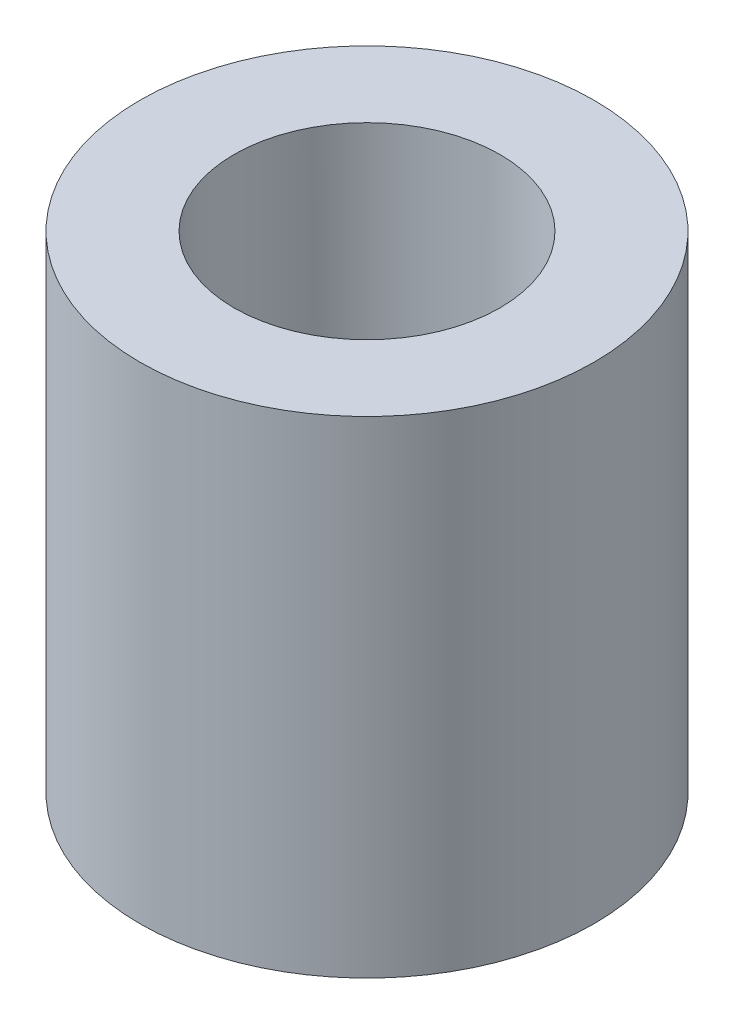
ISO-10303-21;
HEADER;
FILE_DESCRIPTION(('STEP AP214'),'2;1');
FILE_NAME('part.step','',(''),(''),'','','');
FILE_SCHEMA(('AUTOMOTIVE_DESIGN { 1 0 10303 214 1 1 1 1 }'));
ENDSEC;
DATA;
#1=APPLICATION_CONTEXT('core data for automotive mechanical design processes');
#2=APPLICATION_PROTOCOL_DEFINITION('international standard','automotive_design',2000,#1);
#3=PRODUCT_CONTEXT('',#1,'mechanical');
#4=PRODUCT('Part','Part','',(#3));
#5=PRODUCT_RELATED_PRODUCT_CATEGORY('part','',(#4));
#6=PRODUCT_DEFINITION_FORMATION('','',#4);
#7=PRODUCT_DEFINITION_CONTEXT('part definition',#1,'design');
#8=PRODUCT_DEFINITION('design','',#6,#7);
#9=PRODUCT_DEFINITION_SHAPE('','',#8);
#10=(LENGTH_UNIT() NAMED_UNIT(*) SI_UNIT(.MILLI.,.METRE.));
#11=(NAMED_UNIT(*) PLANE_ANGLE_UNIT() SI_UNIT($,.RADIAN.));
#12=(NAMED_UNIT(*) SI_UNIT($,.STERADIAN.) SOLID_ANGLE_UNIT());
#13=UNCERTAINTY_MEASURE_WITH_UNIT(LENGTH_MEASURE(1.E-05),#10,'distance_accuracy_value','');
#14=(GEOMETRIC_REPRESENTATION_CONTEXT(3) GLOBAL_UNCERTAINTY_ASSIGNED_CONTEXT((#13)) GLOBAL_UNIT_ASSIGNED_CONTEXT((#10,
#11,#12)) REPRESENTATION_CONTEXT('',''));
#15=CARTESIAN_POINT('',(0.,0.,0.));
#16=DIRECTION('',(0.,0.,1.));
#17=DIRECTION('',(1.,0.,0.));
#18=AXIS2_PLACEMENT_3D('',#15,#16,#17);
#19=CARTESIAN_POINT('',(0.,4.,0.));
#20=DIRECTION('',(0.,1.,0.));
#21=DIRECTION('',(0.,0.,1.));
#22=AXIS2_PLACEMENT_3D('',#19,#20,#21);
#23=PLANE('',#22);
#24=CARTESIAN_POINT('',(0.,4.,0.));
#25=DIRECTION('',(0.,1.,0.));
#26=DIRECTION('',(0.,0.,1.));
#27=AXIS2_PLACEMENT_3D('',#24,#25,#26);
#28=CIRCLE('',#27,4.1);
#29=CARTESIAN_POINT('',(-3.1,4.,-2.68328157299975));
#30=VERTEX_POINT('',#29);
#31=CARTESIAN_POINT('',(-3.1,4.,2.68328157299975));
#32=VERTEX_POINT('',#31);
#33=EDGE_CURVE('E136',#30,#32,#28,.T.);
#34=ORIENTED_EDGE('',*,*,#33,.T.);
#35=DIRECTION('',(0.,0.,-1.));
#36=VECTOR('',#35,1.);
#37=CARTESIAN_POINT('',(-3.1,4.,3.1));
#38=LINE('',#37,#36);
#39=EDGE_CURVE('E108',#32,#30,#38,.T.);
#40=ORIENTED_EDGE('',*,*,#39,.T.);
#41=EDGE_LOOP('',(#34,#40));
#42=FACE_BOUND('',#41,.T.);
#43=ADVANCED_FACE('F35',(#42),#23,.T.);
#44=CARTESIAN_POINT('',(-2.68328157299975,4.,3.1));
#45=VERTEX_POINT('',#44);
#46=CARTESIAN_POINT('',(2.68328157299975,4.,3.1));
#47=VERTEX_POINT('',#46);
#48=EDGE_CURVE('E147',#45,#47,#28,.T.);
#49=ORIENTED_EDGE('',*,*,#48,.T.);
#50=DIRECTION('',(-1.,0.,0.));
#51=VECTOR('',#50,1.);
#52=CARTESIAN_POINT('',(3.1,4.,3.1));
#53=LINE('',#52,#51);
#54=EDGE_CURVE('E180',#47,#45,#53,.T.);
#55=ORIENTED_EDGE('',*,*,#54,.T.);
#56=EDGE_LOOP('',(#49,#55));
#57=FACE_BOUND('',#56,.T.);
#58=ADVANCED_FACE('F200',(#57),#23,.T.);
#59=CARTESIAN_POINT('',(3.1,4.,2.68328157299975));
#60=VERTEX_POINT('',#59);
#61=CARTESIAN_POINT('',(3.1,4.,-2.68328157299975));
#62=VERTEX_POINT('',#61);
#63=EDGE_CURVE('E150',#60,#62,#28,.T.);
#64=ORIENTED_EDGE('',*,*,#63,.T.);
#65=DIRECTION('',(0.,0.,1.));
#66=VECTOR('',#65,1.);
#67=CARTESIAN_POINT('',(3.1,4.,3.1));
#68=LINE('',#67,#66);
#69=EDGE_CURVE('E124',#62,#60,#68,.T.);
#70=ORIENTED_EDGE('',*,*,#69,.T.);
#71=EDGE_LOOP('',(#64,#70));
#72=FACE_BOUND('',#71,.T.);
#73=ADVANCED_FACE('F187',(#72),#23,.T.);
#74=CARTESIAN_POINT('',(2.68328157299975,4.,-3.1));
#75=VERTEX_POINT('',#74);
#76=CARTESIAN_POINT('',(-2.68328157299975,4.,-3.1));
#77=VERTEX_POINT('',#76);
#78=EDGE_CURVE('E146',#75,#77,#28,.T.);
#79=ORIENTED_EDGE('',*,*,#78,.T.);
#80=DIRECTION('',(1.,0.,0.));
#81=VECTOR('',#80,1.);
#82=CARTESIAN_POINT('',(3.1,4.,-3.1));
#83=LINE('',#82,#81);
#84=EDGE_CURVE('E121',#77,#75,#83,.T.);
#85=ORIENTED_EDGE('',*,*,#84,.T.);
#86=EDGE_LOOP('',(#79,#85));
#87=FACE_BOUND('',#86,.T.);
#88=ADVANCED_FACE('F191',(#87),#23,.T.);
#89=CARTESIAN_POINT('',(0.,15.,0.));
#90=DIRECTION('',(0.,-1.,0.));
#91=DIRECTION('',(0.,0.,-1.));
#92=AXIS2_PLACEMENT_3D('',#89,#90,#91);
#93=CYLINDRICAL_SURFACE('',#92,7.);
#94=CARTESIAN_POINT('',(0.,15.,0.));
#95=DIRECTION('',(0.,1.,0.));
#96=DIRECTION('',(0.,0.,1.));
#97=AXIS2_PLACEMENT_3D('',#94,#95,#96);
#98=CIRCLE('',#97,7.);
#99=CARTESIAN_POINT('',(0.,15.,7.));
#100=VERTEX_POINT('',#99);
#101=EDGE_CURVE('E11',#100,#100,#98,.T.);
#102=ORIENTED_EDGE('',*,*,#101,.F.);
#103=EDGE_LOOP('',(#102));
#104=FACE_BOUND('',#103,.T.);
#105=CARTESIAN_POINT('',(0.,0.,0.));
#106=DIRECTION('',(0.,1.,0.));
#107=DIRECTION('',(0.,0.,1.));
#108=AXIS2_PLACEMENT_3D('',#105,#106,#107);
#109=CIRCLE('',#108,7.);
#110=CARTESIAN_POINT('',(0.,0.,7.));
#111=VERTEX_POINT('',#110);
#112=EDGE_CURVE('E39',#111,#111,#109,.T.);
#113=ORIENTED_EDGE('',*,*,#112,.T.);
#114=EDGE_LOOP('',(#113));
#115=FACE_BOUND('',#114,.T.);
#116=ADVANCED_FACE('F37',(#104,#115),#93,.T.);
#117=CARTESIAN_POINT('',(0.,15.,0.));
#118=DIRECTION('',(0.,1.,0.));
#119=DIRECTION('',(0.,0.,1.));
#120=AXIS2_PLACEMENT_3D('',#117,#118,#119);
#121=PLANE('',#120);
#122=CARTESIAN_POINT('',(0.,15.,0.));
#123=DIRECTION('',(0.,1.,0.));
#124=DIRECTION('',(0.,0.,1.));
#125=AXIS2_PLACEMENT_3D('',#122,#123,#124);
#126=CIRCLE('',#125,4.1);
#127=CARTESIAN_POINT('',(0.,15.,4.1));
#128=VERTEX_POINT('',#127);
#129=EDGE_CURVE('E152',#128,#128,#126,.T.);
#130=ORIENTED_EDGE('',*,*,#129,.F.);
#131=EDGE_LOOP('',(#130));
#132=FACE_BOUND('',#131,.T.);
#133=ORIENTED_EDGE('',*,*,#101,.T.);
#134=EDGE_LOOP('',(#133));
#135=FACE_BOUND('',#134,.T.);
#136=ADVANCED_FACE('F198',(#132,#135),#121,.T.);
#137=CARTESIAN_POINT('',(0.,0.,0.));
#138=DIRECTION('',(0.,1.,0.));
#139=DIRECTION('',(0.,0.,1.));
#140=AXIS2_PLACEMENT_3D('',#137,#138,#139);
#141=PLANE('',#140);
#142=DIRECTION('',(1.,0.,0.));
#143=VECTOR('',#142,1.);
#144=CARTESIAN_POINT('',(3.1,0.,-3.1));
#145=LINE('',#144,#143);
#146=CARTESIAN_POINT('',(-3.1,0.,-3.1));
#147=VERTEX_POINT('',#146);
#148=CARTESIAN_POINT('',(3.1,0.,-3.1));
#149=VERTEX_POINT('',#148);
#150=EDGE_CURVE('E172',#147,#149,#145,.T.);
#151=ORIENTED_EDGE('',*,*,#150,.F.);
#152=DIRECTION('',(0.,0.,-1.));
#153=VECTOR('',#152,1.);
#154=CARTESIAN_POINT('',(-3.1,0.,3.1));
#155=LINE('',#154,#153);
#156=CARTESIAN_POINT('',(-3.1,0.,3.1));
#157=VERTEX_POINT('',#156);
#158=EDGE_CURVE('E58',#157,#147,#155,.T.);
#159=ORIENTED_EDGE('',*,*,#158,.F.);
#160=DIRECTION('',(-1.,0.,0.));
#161=VECTOR('',#160,1.);
#162=CARTESIAN_POINT('',(3.1,0.,3.1));
#163=LINE('',#162,#161);
#164=CARTESIAN_POINT('',(3.1,0.,3.1));
#165=VERTEX_POINT('',#164);
#166=EDGE_CURVE('E109',#165,#157,#163,.T.);
#167=ORIENTED_EDGE('',*,*,#166,.F.);
#168=DIRECTION('',(0.,0.,1.));
#169=VECTOR('',#168,1.);
#170=CARTESIAN_POINT('',(3.1,0.,3.1));
#171=LINE('',#170,#169);
#172=EDGE_CURVE('E170',#149,#165,#171,.T.);
#173=ORIENTED_EDGE('',*,*,#172,.F.);
#174=EDGE_LOOP('',(#151,#159,#167,#173));
#175=FACE_BOUND('',#174,.T.);
#176=ORIENTED_EDGE('',*,*,#112,.F.);
#177=EDGE_LOOP('',(#176));
#178=FACE_BOUND('',#177,.T.);
#179=ADVANCED_FACE('F175',(#175,#178),#141,.F.);
#180=CARTESIAN_POINT('',(0.,4.,0.));
#181=DIRECTION('',(0.,1.,0.));
#182=DIRECTION('',(0.,0.,1.));
#183=AXIS2_PLACEMENT_3D('',#180,#181,#182);
#184=CYLINDRICAL_SURFACE('',#183,4.1);
#185=EDGE_CURVE('E148',#47,#60,#28,.T.);
#186=ORIENTED_EDGE('',*,*,#185,.F.);
#187=ORIENTED_EDGE('',*,*,#48,.F.);
#188=EDGE_CURVE('E144',#32,#45,#28,.T.);
#189=ORIENTED_EDGE('',*,*,#188,.F.);
#190=ORIENTED_EDGE('',*,*,#33,.F.);
#191=EDGE_CURVE('E106',#77,#30,#28,.T.);
#192=ORIENTED_EDGE('',*,*,#191,.F.);
#193=ORIENTED_EDGE('',*,*,#78,.F.);
#194=EDGE_CURVE('E189',#62,#75,#28,.T.);
#195=ORIENTED_EDGE('',*,*,#194,.F.);
#196=ORIENTED_EDGE('',*,*,#63,.F.);
#197=EDGE_LOOP('',(#186,#187,#189,#190,#192,#193,#195,#196));
#198=FACE_BOUND('',#197,.T.);
#199=ORIENTED_EDGE('',*,*,#129,.T.);
#200=EDGE_LOOP('',(#199));
#201=FACE_BOUND('',#200,.T.);
#202=ADVANCED_FACE('F139',(#198,#201),#184,.F.);
#203=CARTESIAN_POINT('',(0.,4.,0.));
#204=DIRECTION('',(0.,1.,0.));
#205=DIRECTION('',(0.,0.,1.));
#206=AXIS2_PLACEMENT_3D('',#203,#204,#205);
#207=PLANE('',#206);
#208=ORIENTED_EDGE('',*,*,#185,.T.);
#209=CARTESIAN_POINT('',(3.1,4.,3.1));
#210=VERTEX_POINT('',#209);
#211=EDGE_CURVE('E122',#60,#210,#68,.T.);
#212=ORIENTED_EDGE('',*,*,#211,.T.);
#213=EDGE_CURVE('E117',#210,#47,#53,.T.);
#214=ORIENTED_EDGE('',*,*,#213,.T.);
#215=EDGE_LOOP('',(#208,#212,#214));
#216=FACE_BOUND('',#215,.T.);
#217=ADVANCED_FACE('F216',(#216),#207,.F.);
#218=ORIENTED_EDGE('',*,*,#194,.T.);
#219=CARTESIAN_POINT('',(3.1,4.,-3.1));
#220=VERTEX_POINT('',#219);
#221=EDGE_CURVE('E50',#75,#220,#83,.T.);
#222=ORIENTED_EDGE('',*,*,#221,.T.);
#223=EDGE_CURVE('E126',#220,#62,#68,.T.);
#224=ORIENTED_EDGE('',*,*,#223,.T.);
#225=EDGE_LOOP('',(#218,#222,#224));
#226=FACE_BOUND('',#225,.T.);
#227=ADVANCED_FACE('F218',(#226),#207,.F.);
#228=ORIENTED_EDGE('',*,*,#191,.T.);
#229=CARTESIAN_POINT('',(-3.1,4.,-3.1));
#230=VERTEX_POINT('',#229);
#231=EDGE_CURVE('E101',#30,#230,#38,.T.);
#232=ORIENTED_EDGE('',*,*,#231,.T.);
#233=EDGE_CURVE('E104',#230,#77,#83,.T.);
#234=ORIENTED_EDGE('',*,*,#233,.T.);
#235=EDGE_LOOP('',(#228,#232,#234));
#236=FACE_BOUND('',#235,.T.);
#237=ADVANCED_FACE('F102',(#236),#207,.F.);
#238=CARTESIAN_POINT('',(-3.1,4.,3.1));
#239=DIRECTION('',(-1.,0.,0.));
#240=DIRECTION('',(0.,0.,1.));
#241=AXIS2_PLACEMENT_3D('',#238,#239,#240);
#242=PLANE('',#241);
#243=ORIENTED_EDGE('',*,*,#158,.T.);
#244=DIRECTION('',(0.,-1.,0.));
#245=VECTOR('',#244,1.);
#246=CARTESIAN_POINT('',(-3.1,4.,-3.1));
#247=LINE('',#246,#245);
#248=EDGE_CURVE('E112',#230,#147,#247,.T.);
#249=ORIENTED_EDGE('',*,*,#248,.F.);
#250=ORIENTED_EDGE('',*,*,#231,.F.);
#251=ORIENTED_EDGE('',*,*,#39,.F.);
#252=CARTESIAN_POINT('',(-3.1,4.,3.1));
#253=VERTEX_POINT('',#252);
#254=EDGE_CURVE('E111',#253,#32,#38,.T.);
#255=ORIENTED_EDGE('',*,*,#254,.F.);
#256=DIRECTION('',(0.,-1.,0.));
#257=VECTOR('',#256,1.);
#258=CARTESIAN_POINT('',(-3.1,4.,3.1));
#259=LINE('',#258,#257);
#260=EDGE_CURVE('E154',#253,#157,#259,.T.);
#261=ORIENTED_EDGE('',*,*,#260,.T.);
#262=EDGE_LOOP('',(#243,#249,#250,#251,#255,#261));
#263=FACE_BOUND('',#262,.T.);
#264=ADVANCED_FACE('F113',(#263),#242,.F.);
#265=CARTESIAN_POINT('',(3.1,4.,3.1));
#266=DIRECTION('',(0.,0.,1.));
#267=DIRECTION('',(1.,0.,0.));
#268=AXIS2_PLACEMENT_3D('',#265,#266,#267);
#269=PLANE('',#268);
#270=ORIENTED_EDGE('',*,*,#166,.T.);
#271=ORIENTED_EDGE('',*,*,#260,.F.);
#272=EDGE_CURVE('E181',#45,#253,#53,.T.);
#273=ORIENTED_EDGE('',*,*,#272,.F.);
#274=ORIENTED_EDGE('',*,*,#54,.F.);
#275=ORIENTED_EDGE('',*,*,#213,.F.);
#276=DIRECTION('',(0.,-1.,0.));
#277=VECTOR('',#276,1.);
#278=CARTESIAN_POINT('',(3.1,4.,3.1));
#279=LINE('',#278,#277);
#280=EDGE_CURVE('E157',#210,#165,#279,.T.);
#281=ORIENTED_EDGE('',*,*,#280,.T.);
#282=EDGE_LOOP('',(#270,#271,#273,#274,#275,#281));
#283=FACE_BOUND('',#282,.T.);
#284=ADVANCED_FACE('F214',(#283),#269,.F.);
#285=CARTESIAN_POINT('',(3.1,4.,3.1));
#286=DIRECTION('',(1.,0.,0.));
#287=DIRECTION('',(0.,0.,-1.));
#288=AXIS2_PLACEMENT_3D('',#285,#286,#287);
#289=PLANE('',#288);
#290=ORIENTED_EDGE('',*,*,#172,.T.);
#291=ORIENTED_EDGE('',*,*,#280,.F.);
#292=ORIENTED_EDGE('',*,*,#211,.F.);
#293=ORIENTED_EDGE('',*,*,#69,.F.);
#294=ORIENTED_EDGE('',*,*,#223,.F.);
#295=DIRECTION('',(0.,-1.,0.));
#296=VECTOR('',#295,1.);
#297=CARTESIAN_POINT('',(3.1,4.,-3.1));
#298=LINE('',#297,#296);
#299=EDGE_CURVE('E116',#220,#149,#298,.T.);
#300=ORIENTED_EDGE('',*,*,#299,.T.);
#301=EDGE_LOOP('',(#290,#291,#292,#293,#294,#300));
#302=FACE_BOUND('',#301,.T.);
#303=ADVANCED_FACE('F167',(#302),#289,.F.);
#304=CARTESIAN_POINT('',(3.1,4.,-3.1));
#305=DIRECTION('',(0.,0.,-1.));
#306=DIRECTION('',(-1.,0.,0.));
#307=AXIS2_PLACEMENT_3D('',#304,#305,#306);
#308=PLANE('',#307);
#309=ORIENTED_EDGE('',*,*,#150,.T.);
#310=ORIENTED_EDGE('',*,*,#299,.F.);
#311=ORIENTED_EDGE('',*,*,#221,.F.);
#312=ORIENTED_EDGE('',*,*,#84,.F.);
#313=ORIENTED_EDGE('',*,*,#233,.F.);
#314=ORIENTED_EDGE('',*,*,#248,.T.);
#315=EDGE_LOOP('',(#309,#310,#311,#312,#313,#314));
#316=FACE_BOUND('',#315,.T.);
#317=ADVANCED_FACE('F119',(#316),#308,.F.);
#318=ORIENTED_EDGE('',*,*,#188,.T.);
#319=ORIENTED_EDGE('',*,*,#272,.T.);
#320=ORIENTED_EDGE('',*,*,#254,.T.);
#321=EDGE_LOOP('',(#318,#319,#320));
#322=FACE_BOUND('',#321,.T.);
#323=ADVANCED_FACE('F220',(#322),#207,.F.);
#324=CLOSED_SHELL('',(#43,#58,#73,#88,#116,#136,#179,#202,#217,#227,#237,#264,#284,#303,#317,#323));
#325=MANIFOLD_SOLID_BREP('B2',#324);
#326=ADVANCED_BREP_SHAPE_REPRESENTATION('',(#18,#325),#14);
#327=SHAPE_DEFINITION_REPRESENTATION(#9,#326);
ENDSEC;
END-ISO-10303-21;
